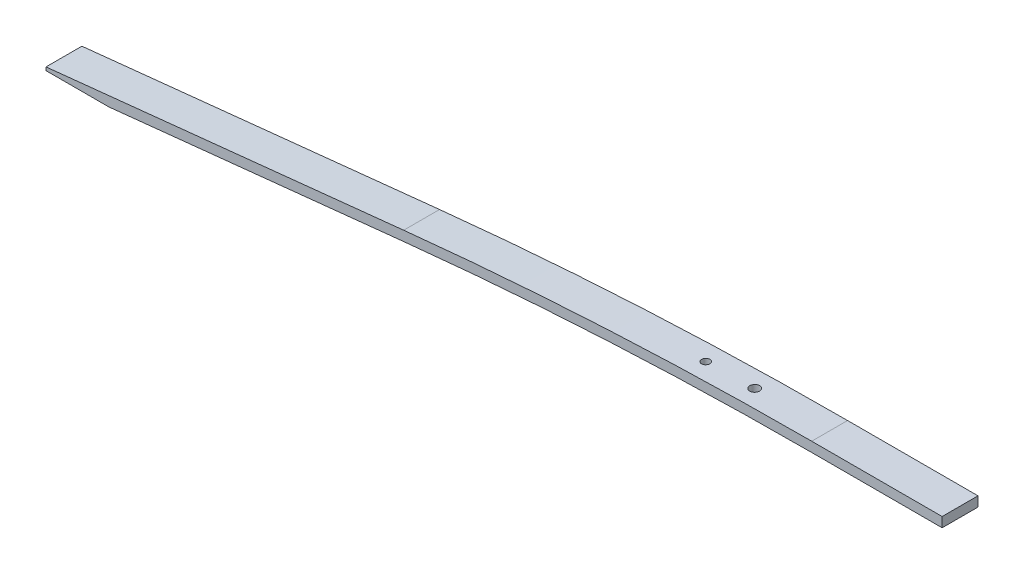
ISO-10303-21;
HEADER;
FILE_DESCRIPTION(('STEP AP214'),'2;1');
FILE_NAME('part.step','',(''),(''),'','','');
FILE_SCHEMA(('AUTOMOTIVE_DESIGN { 1 0 10303 214 1 1 1 1 }'));
ENDSEC;
DATA;
#1=APPLICATION_CONTEXT('core data for automotive mechanical design processes');
#2=APPLICATION_PROTOCOL_DEFINITION('international standard','automotive_design',2000,#1);
#3=PRODUCT_CONTEXT('',#1,'mechanical');
#4=PRODUCT('Part','Part','',(#3));
#5=PRODUCT_RELATED_PRODUCT_CATEGORY('part','',(#4));
#6=PRODUCT_DEFINITION_FORMATION('','',#4);
#7=PRODUCT_DEFINITION_CONTEXT('part definition',#1,'design');
#8=PRODUCT_DEFINITION('design','',#6,#7);
#9=PRODUCT_DEFINITION_SHAPE('','',#8);
#10=(LENGTH_UNIT() NAMED_UNIT(*) SI_UNIT(.MILLI.,.METRE.));
#11=(NAMED_UNIT(*) PLANE_ANGLE_UNIT() SI_UNIT($,.RADIAN.));
#12=(NAMED_UNIT(*) SI_UNIT($,.STERADIAN.) SOLID_ANGLE_UNIT());
#13=UNCERTAINTY_MEASURE_WITH_UNIT(LENGTH_MEASURE(1.E-05),#10,'distance_accuracy_value','');
#14=(GEOMETRIC_REPRESENTATION_CONTEXT(3) GLOBAL_UNCERTAINTY_ASSIGNED_CONTEXT((#13)) GLOBAL_UNIT_ASSIGNED_CONTEXT((#10,
#11,#12)) REPRESENTATION_CONTEXT('',''));
#15=CARTESIAN_POINT('',(0.,0.,0.));
#16=DIRECTION('',(0.,0.,1.));
#17=DIRECTION('',(1.,0.,0.));
#18=AXIS2_PLACEMENT_3D('',#15,#16,#17);
#19=CARTESIAN_POINT('',(-39.9999999999999,-1181.5,5.5));
#20=DIRECTION('',(0.,0.,-1.));
#21=DIRECTION('',(-1.,0.,0.));
#22=AXIS2_PLACEMENT_3D('',#19,#20,#21);
#23=CYLINDRICAL_SURFACE('',#22,1203.);
#24=CARTESIAN_POINT('',(-63.,21.2801129050981,-1.5));
#25=CARTESIAN_POINT('',(-63.0842683275522,21.2785014827461,-1.49999626485822));
#26=CARTESIAN_POINT('',(-63.1685975877517,21.2768799662552,-1.49287504243812));
#27=CARTESIAN_POINT('',(-63.3349334916053,21.2736644200407,-1.46456582440662));
#28=CARTESIAN_POINT('',(-63.4169372149828,21.2720704257815,-1.44336089381558));
#29=CARTESIAN_POINT('',(-63.5761884169983,21.2689593933607,-1.38748729776392));
#30=CARTESIAN_POINT('',(-63.6534381321364,21.2674423190724,-1.35282502021609));
#31=CARTESIAN_POINT('',(-63.8010004359382,21.2645313325327,-1.27102872028861));
#32=CARTESIAN_POINT('',(-63.8713147461398,21.2631373897259,-1.22389780368153));
#33=CARTESIAN_POINT('',(-64.0030365505379,21.2605158899347,-1.11849567663404));
#34=CARTESIAN_POINT('',(-64.0644437578657,21.2592883383092,-1.06022410752971));
#35=CARTESIAN_POINT('',(-64.1766055267503,21.2570390151202,-0.934192625237201));
#36=CARTESIAN_POINT('',(-64.227359679065,21.2560172514622,-0.866432347702361));
#37=CARTESIAN_POINT('',(-64.3167609933638,21.2542131046966,-0.723363238031076));
#38=CARTESIAN_POINT('',(-64.3554105789905,21.2534306736692,-0.648055920995248));
#39=CARTESIAN_POINT('',(-64.4195179260495,21.2521308142561,-0.492019423846686));
#40=CARTESIAN_POINT('',(-64.4449757286982,21.2516133850425,-0.411290260674865));
#41=CARTESIAN_POINT('',(-64.4819724833929,21.2508608890234,-0.246717462662911));
#42=CARTESIAN_POINT('',(-64.4935139803227,21.2506257705915,-0.162874400155196));
#43=CARTESIAN_POINT('',(-64.502358518648,21.2504456234909,0.00555952510740368));
#44=CARTESIAN_POINT('',(-64.4996615957653,21.2505005940944,0.0901503859856601));
#45=CARTESIAN_POINT('',(-64.4801069780458,21.2508987550016,0.257670324424421));
#46=CARTESIAN_POINT('',(-64.4632506262797,21.2512419179692,0.340599558832091));
#47=CARTESIAN_POINT('',(-64.4158579572455,21.2522049189069,0.502450715037225));
#48=CARTESIAN_POINT('',(-64.3853216249189,21.2528247571816,0.581372632423434));
#49=CARTESIAN_POINT('',(-64.3114349986412,21.2543205022846,0.732972722990516));
#50=CARTESIAN_POINT('',(-64.2680841459908,21.2551964202777,0.805650623760621));
#51=CARTESIAN_POINT('',(-64.1698003781107,21.2571754753311,0.942696895225847));
#52=CARTESIAN_POINT('',(-64.1148674587048,21.2582786124733,1.00706526292478));
#53=CARTESIAN_POINT('',(-63.9949696368075,21.2606765351772,1.12567650076369));
#54=CARTESIAN_POINT('',(-63.9300031288645,21.2619713514077,1.17991774741263));
#55=CARTESIAN_POINT('',(-63.7918889331527,21.2647113145791,1.27672380697865));
#56=CARTESIAN_POINT('',(-63.7187412354787,21.2661564617021,1.31928860575835));
#57=CARTESIAN_POINT('',(-63.5663257408067,21.2691524541841,1.39154205415484));
#58=CARTESIAN_POINT('',(-63.4870567571272,21.2707033200311,1.42122819967749));
#59=CARTESIAN_POINT('',(-63.3246610284746,21.2738635250655,1.46687052379746));
#60=CARTESIAN_POINT('',(-63.2415342803373,21.2754728643009,1.48282669113339));
#61=CARTESIAN_POINT('',(-63.0737706319632,21.2787028987153,1.50055776488412));
#62=CARTESIAN_POINT('',(-62.9891335286348,21.2803235954035,1.50233074951858));
#63=CARTESIAN_POINT('',(-62.8207625938515,21.2835299360821,1.49163994435171));
#64=CARTESIAN_POINT('',(-62.7370287626913,21.2851155800611,1.47917614990608));
#65=CARTESIAN_POINT('',(-62.5728397250996,21.2882081449968,1.44036465231928));
#66=CARTESIAN_POINT('',(-62.4923845853229,21.2897150643533,1.41401666706851));
#67=CARTESIAN_POINT('',(-62.3370392674074,21.2926100197493,1.34818381143463));
#68=CARTESIAN_POINT('',(-62.2621490865233,21.2939980558474,1.30869894753246));
#69=CARTESIAN_POINT('',(-62.1200673513715,21.2966194150602,1.21771676375571));
#70=CARTESIAN_POINT('',(-62.052875080903,21.2978527525688,1.16622056275167));
#71=CARTESIAN_POINT('',(-61.928089777219,21.3001341791954,1.05267490478654));
#72=CARTESIAN_POINT('',(-61.8704967402909,21.301182268385,0.990625451907079));
#73=CARTESIAN_POINT('',(-61.7665546041049,21.3030677590313,0.85774508755502));
#74=CARTESIAN_POINT('',(-61.72020374192,21.3039051935225,0.786915555554875));
#75=CARTESIAN_POINT('',(-61.6400513588103,21.3053499178745,0.638478027558064));
#76=CARTESIAN_POINT('',(-61.6062498136728,21.3059572081795,0.560870044640165));
#77=CARTESIAN_POINT('',(-61.5521608546186,21.3069276069541,0.40109152948188));
#78=CARTESIAN_POINT('',(-61.5318713508546,21.3072907531844,0.31892170493206));
#79=CARTESIAN_POINT('',(-61.5053746519992,21.3077647900969,0.152341228465346));
#80=CARTESIAN_POINT('',(-61.4991674733716,21.3078756804842,0.0679305739287923));
#81=CARTESIAN_POINT('',(-61.501011796039,21.3078427132083,-0.10072667719108));
#82=CARTESIAN_POINT('',(-61.5090619371011,21.3076988798473,-0.18497328865741));
#83=CARTESIAN_POINT('',(-61.5391895516435,21.3071597464815,-0.350919169118943));
#84=CARTESIAN_POINT('',(-61.5612670510785,21.3067644460114,-0.432618433400534));
#85=CARTESIAN_POINT('',(-61.6188226065603,21.3057313348782,-0.59115188314902));
#86=CARTESIAN_POINT('',(-61.6543009062461,21.3050935198061,-0.667985980132988));
#87=CARTESIAN_POINT('',(-61.7376487289079,21.3035900999709,-0.814604082711891));
#88=CARTESIAN_POINT('',(-61.7855177696743,21.3027245040723,-0.884388362517123));
#89=CARTESIAN_POINT('',(-61.892286887398,21.3007859232681,-1.01492961751598));
#90=CARTESIAN_POINT('',(-61.9511868335505,21.2997129408217,-1.075686699739));
#91=CARTESIAN_POINT('',(-62.0783648047131,21.2973851997902,-1.186465650037));
#92=CARTESIAN_POINT('',(-62.1466451637613,21.29613039596,-1.23648483834201));
#93=CARTESIAN_POINT('',(-62.290668718301,21.2934699172252,-1.32437675567405));
#94=CARTESIAN_POINT('',(-62.3664165989247,21.2920641475543,-1.36224179495868));
#95=CARTESIAN_POINT('',(-62.5231327400998,21.2891397115476,-1.42467394797319));
#96=CARTESIAN_POINT('',(-62.6040946182265,21.2876211829035,-1.44925698642593));
#97=CARTESIAN_POINT('',(-62.7379766750937,21.2850959691296,-1.47787805329657));
#98=CARTESIAN_POINT('',(-62.7900275211626,21.2841108801281,-1.48616345171972));
#99=CARTESIAN_POINT('',(-62.8947109809195,21.2821228095619,-1.49722559229224));
#100=CARTESIAN_POINT('',(-62.947343594658,21.2811198279956,-1.50000233396278));
#101=CARTESIAN_POINT('',(-63.,21.2801129050981,-1.5));
#102=B_SPLINE_CURVE_WITH_KNOTS('',3,(#24,#25,#26,#27,#28,#29,#30,#31,#32,#33,#34,#35,#36,#37,
#38,#39,#40,#41,#42,#43,#44,#45,#46,#47,#48,#49,#50,#51,#52,#53,#54,#55,#56,#57,#58,#59,#60,#61,
#62,#63,#64,#65,#66,#67,#68,#69,#70,#71,#72,#73,#74,#75,#76,#77,#78,#79,#80,#81,#82,#83,#84,#85,
#86,#87,#88,#89,#90,#91,#92,#93,#94,#95,#96,#97,#98,#99,#100,#101),.UNSPECIFIED.,.T.,.F.,(4,2,2,
2,2,2,2,2,2,2,2,2,2,2,2,2,2,2,2,2,2,2,2,2,2,2,2,2,2,2,2,2,2,2,2,2,2,2,4),(0.,0.252658982755233,
0.505622327116735,0.758465741747327,1.01124623563877,1.26403486895602,1.51683321149394,
1.76958090495644,2.022327808729,2.27502848549765,2.5277285282845,2.78040460430839,
3.03308095847208,3.28576833067874,3.53845579399725,3.7911837312322,4.04391197445887,
4.29668933555308,4.54946690397615,4.8022787224507,5.05509062339745,5.30790766136777,
5.56072457461346,5.81351794705728,6.06631122172977,6.31906482928582,6.57181794917405,
6.82453196777634,7.07724628182889,7.32993648673561,7.58262715919264,7.83532242602248,
8.08800786020801,8.34069029823328,8.5934357230661,8.84634074227099,9.09894185918761,
9.25681983112918,9.41469781679367),.UNSPECIFIED.);
#103=CARTESIAN_POINT('',(-63.,21.2801129050981,-1.5));
#104=VERTEX_POINT('',#103);
#105=EDGE_CURVE('E125',#104,#104,#102,.T.);
#106=ORIENTED_EDGE('',*,*,#105,.F.);
#107=EDGE_LOOP('',(#106));
#108=FACE_BOUND('',#107,.T.);
#109=CARTESIAN_POINT('',(-39.9999999999999,-1181.5,-5.5));
#110=DIRECTION('',(0.,0.,1.));
#111=DIRECTION('',(1.,0.,0.));
#112=AXIS2_PLACEMENT_3D('',#109,#110,#111);
#113=CIRCLE('',#112,1203.);
#114=CARTESIAN_POINT('',(-40.0000000000003,21.5000000000003,-5.5));
#115=VERTEX_POINT('',#114);
#116=CARTESIAN_POINT('',(-165.139891451655,14.973571612624,-5.5));
#117=VERTEX_POINT('',#116);
#118=EDGE_CURVE('E113',#115,#117,#113,.T.);
#119=ORIENTED_EDGE('',*,*,#118,.T.);
#120=DIRECTION('',(0.,0.,-1.));
#121=VECTOR('',#120,1.);
#122=CARTESIAN_POINT('',(-165.139891451655,14.973571612624,5.5));
#123=LINE('',#122,#121);
#124=CARTESIAN_POINT('',(-165.139891451655,14.973571612624,5.5));
#125=VERTEX_POINT('',#124);
#126=EDGE_CURVE('E180',#125,#117,#123,.T.);
#127=ORIENTED_EDGE('',*,*,#126,.F.);
#128=CARTESIAN_POINT('',(-39.9999999999999,-1181.5,5.5));
#129=DIRECTION('',(0.,0.,1.));
#130=DIRECTION('',(1.,0.,0.));
#131=AXIS2_PLACEMENT_3D('',#128,#129,#130);
#132=CIRCLE('',#131,1203.);
#133=CARTESIAN_POINT('',(-40.0000000000003,21.5000000000003,5.5));
#134=VERTEX_POINT('',#133);
#135=EDGE_CURVE('E152',#134,#125,#132,.T.);
#136=ORIENTED_EDGE('',*,*,#135,.F.);
#137=DIRECTION('',(0.,0.,-1.));
#138=VECTOR('',#137,1.);
#139=CARTESIAN_POINT('',(-40.0000000000003,21.5000000000003,5.5));
#140=LINE('',#139,#138);
#141=EDGE_CURVE('E43',#134,#115,#140,.T.);
#142=ORIENTED_EDGE('',*,*,#141,.T.);
#143=EDGE_LOOP('',(#119,#127,#136,#142));
#144=FACE_BOUND('',#143,.T.);
#145=CARTESIAN_POINT('',(-78.,20.8996839653612,-1.25));
#146=CARTESIAN_POINT('',(-78.0702405265001,20.8974641123236,-1.24999688926679));
#147=CARTESIAN_POINT('',(-78.1405317832027,20.8952364464983,-1.2440597052345));
#148=CARTESIAN_POINT('',(-78.2791785067874,20.8908305206302,-1.22045714243557));
#149=CARTESIAN_POINT('',(-78.347531539577,20.8886523233403,-1.20277764314792));
#150=CARTESIAN_POINT('',(-78.4802736174164,20.8844114718202,-1.15619217972843));
#151=CARTESIAN_POINT('',(-78.5446645012633,20.882348764033,-1.1272914694816));
#152=CARTESIAN_POINT('',(-78.6676630699334,20.8783995165602,-1.05908952660006));
#153=CARTESIAN_POINT('',(-78.7262721934895,20.8765129330541,-1.0197908903923));
#154=CARTESIAN_POINT('',(-78.836056194155,20.8729719853001,-0.931908371602947));
#155=CARTESIAN_POINT('',(-78.8872318572814,20.8713175965005,-0.883325472002594));
#156=CARTESIAN_POINT('',(-78.9807016002234,20.8682909555498,-0.778247456985239));
#157=CARTESIAN_POINT('',(-79.0229953516548,20.8669187138305,-0.721752049153747));
#158=CARTESIAN_POINT('',(-79.0974756578555,20.864499139159,-0.602484598538141));
#159=CARTESIAN_POINT('',(-79.1296672890259,20.8634516430226,-0.53971572919772));
#160=CARTESIAN_POINT('',(-79.1830553551444,20.8617130009673,-0.409659839869621));
#161=CARTESIAN_POINT('',(-79.2042518435865,20.8610218533147,-0.342372841865565));
#162=CARTESIAN_POINT('',(-79.2350383947384,20.8600176327435,-0.205224760663816));
#163=CARTESIAN_POINT('',(-79.2446339272386,20.8597043816488,-0.135364906577892));
#164=CARTESIAN_POINT('',(-79.2519634399417,20.8594651268796,0.00497477586042579));
#165=CARTESIAN_POINT('',(-79.2496974626356,20.8595391218179,0.0754546019910284));
#166=CARTESIAN_POINT('',(-79.2333705749958,20.860071982854,0.215015914185071));
#167=CARTESIAN_POINT('',(-79.2193124814289,20.8605307570401,0.28409773015384));
#168=CARTESIAN_POINT('',(-79.1798053186225,20.8618187727725,0.418919895141983));
#169=CARTESIAN_POINT('',(-79.154356236355,20.8626480147424,0.484660240339556));
#170=CARTESIAN_POINT('',(-79.0927878313188,20.8646513781126,0.610941666914802));
#171=CARTESIAN_POINT('',(-79.0566673350277,20.8658255374429,0.671482175527246));
#172=CARTESIAN_POINT('',(-78.9747842571552,20.8684825644781,0.785639792126062));
#173=CARTESIAN_POINT('',(-78.9290216611103,20.8699654326461,0.839256889726944));
#174=CARTESIAN_POINT('',(-78.8291339206092,20.8731953312069,0.938069459393236));
#175=CARTESIAN_POINT('',(-78.7750053842441,20.8749424687395,0.983261499111676));
#176=CARTESIAN_POINT('',(-78.6599364088484,20.878647774865,1.06391754787876));
#177=CARTESIAN_POINT('',(-78.5989959498995,20.8806059440749,1.09938152848133));
#178=CARTESIAN_POINT('',(-78.4719996424118,20.8846760820958,1.15959355825824));
#179=CARTESIAN_POINT('',(-78.4059412065071,20.886788128666,1.18433614506745));
#180=CARTESIAN_POINT('',(-78.2706106523374,20.8911031525725,1.22237895695318));
#181=CARTESIAN_POINT('',(-78.2013385265574,20.8933061301214,1.23567915527161));
#182=CARTESIAN_POINT('',(-78.0615189503606,20.8977402124623,1.25046362975066));
#183=CARTESIAN_POINT('',(-77.9909710283554,20.8999713275589,1.25194344326408));
#184=CARTESIAN_POINT('',(-77.8506275657637,20.9043974148741,1.24303330905545));
#185=CARTESIAN_POINT('',(-77.7808320259177,20.9065923870571,1.23264334965183));
#186=CARTESIAN_POINT('',(-77.6439687753314,20.9108849746025,1.20028613592511));
#187=CARTESIAN_POINT('',(-77.5769012953895,20.9129825817298,1.17831790424671));
#188=CARTESIAN_POINT('',(-77.4474055480962,20.9170225085798,1.12342553591581));
#189=CARTESIAN_POINT('',(-77.3849772762674,20.9189648284525,1.09050140983754));
#190=CARTESIAN_POINT('',(-77.2665482275182,20.9226411281558,1.01463909220106));
#191=CARTESIAN_POINT('',(-77.2105459674209,20.9243751560664,0.971703218402391));
#192=CARTESIAN_POINT('',(-77.1065449050456,20.9275891037422,0.877030637095595));
#193=CARTESIAN_POINT('',(-77.0585460886829,20.9290690239546,0.825293945075605));
#194=CARTESIAN_POINT('',(-76.9719369737282,20.9317351760606,0.714512222423574));
#195=CARTESIAN_POINT('',(-76.9333226161052,20.9329215349314,0.655470368206581));
#196=CARTESIAN_POINT('',(-76.8665547437801,20.9349704919207,0.531736592881054));
#197=CARTESIAN_POINT('',(-76.8384011914606,20.9358330912034,0.467044692091357));
#198=CARTESIAN_POINT('',(-76.7933669270441,20.9372119412661,0.333878373157274));
#199=CARTESIAN_POINT('',(-76.7764811670088,20.9377283471402,0.265405663710645));
#200=CARTESIAN_POINT('',(-76.7544430855582,20.9384021798717,0.126595552407409));
#201=CARTESIAN_POINT('',(-76.7492907630984,20.938559606761,0.0562581507167891));
#202=CARTESIAN_POINT('',(-76.750866101445,20.9385114596353,-0.0842634804190168));
#203=CARTESIAN_POINT('',(-76.7575904204575,20.9383059877309,-0.154447747389243));
#204=CARTESIAN_POINT('',(-76.7827211468489,20.9375374966255,-0.2926907256518));
#205=CARTESIAN_POINT('',(-76.8011275723121,20.9369744768709,-0.360749433653527));
#206=CARTESIAN_POINT('',(-76.849099061916,20.9355053267315,-0.492810833411267));
#207=CARTESIAN_POINT('',(-76.878664321969,20.9345991903227,-0.556813453932706));
#208=CARTESIAN_POINT('',(-76.9481112873589,20.9324672404068,-0.678943701741664));
#209=CARTESIAN_POINT('',(-76.9879925988712,20.9312414391032,-0.737071553186012));
#210=CARTESIAN_POINT('',(-77.0769458487,20.9285018500472,-0.845817194816037));
#211=CARTESIAN_POINT('',(-77.1260193759767,20.9269880125045,-0.896433683877602));
#212=CARTESIAN_POINT('',(-77.2319743089951,20.9237118803487,-0.988722877611554));
#213=CARTESIAN_POINT('',(-77.2888576690365,20.9219495235442,-1.03039333695497));
#214=CARTESIAN_POINT('',(-77.4088544857664,20.9182222547882,-1.10362783833412));
#215=CARTESIAN_POINT('',(-77.4719736530704,20.9162571570966,-1.13518250218706));
#216=CARTESIAN_POINT('',(-77.6025596881592,20.9121804749191,-1.1872109793965));
#217=CARTESIAN_POINT('',(-77.6700212507452,20.9100690689486,-1.2076980371596));
#218=CARTESIAN_POINT('',(-77.7815930516467,20.9065672982061,-1.23155584341853));
#219=CARTESIAN_POINT('',(-77.8249795864705,20.9052032589859,-1.23846380708468));
#220=CARTESIAN_POINT('',(-77.9122374780427,20.902455151833,-1.24768685786243));
#221=CARTESIAN_POINT('',(-77.9561088349149,20.9010710838952,-1.25000194380241));
#222=CARTESIAN_POINT('',(-78.,20.8996839653612,-1.25));
#223=B_SPLINE_CURVE_WITH_KNOTS('',3,(#145,#146,#147,#148,#149,#150,#151,#152,#153,#154,#155,
#156,#157,#158,#159,#160,#161,#162,#163,#164,#165,#166,#167,#168,#169,#170,#171,#172,#173,#174,
#175,#176,#177,#178,#179,#180,#181,#182,#183,#184,#185,#186,#187,#188,#189,#190,#191,#192,#193,
#194,#195,#196,#197,#198,#199,#200,#201,#202,#203,#204,#205,#206,#207,#208,#209,#210,#211,#212,
#213,#214,#215,#216,#217,#218,#219,#220,#221,#222),.UNSPECIFIED.,.T.,.F.,(4,2,2,2,2,2,2,2,2,2,2,
2,2,2,2,2,2,2,2,2,2,2,2,2,2,2,2,2,2,2,2,2,2,2,2,2,2,2,4),(0.,0.210666539578859,
0.421586872401316,0.632408569037846,0.843177671783519,1.05392447147793,1.26467906158282,
1.47532757549444,1.68597506453892,1.896523195606,2.10707057243968,2.31756767042643,
2.52806500916354,2.73858550465698,2.94910631593887,3.15971270632739,3.37031971254898,
3.58103389360461,3.79174856741517,4.00254279031318,4.21333722066337,4.4241494476288,
4.63496147112639,4.84572473916788,5.05648763630111,5.26715920991632,5.47783002594044,
5.68840639857194,5.89898275245891,6.10949986479555,6.32001730302008,6.53053843740907,
6.74105153614954,6.95160105767633,7.16220336258209,7.37300035244822,7.58354452336481,
7.71518359226914,7.84682269475434),.UNSPECIFIED.);
#224=CARTESIAN_POINT('',(-78.,20.8996839653612,-1.25));
#225=VERTEX_POINT('',#224);
#226=EDGE_CURVE('E186',#225,#225,#223,.T.);
#227=ORIENTED_EDGE('',*,*,#226,.F.);
#228=EDGE_LOOP('',(#227));
#229=FACE_BOUND('',#228,.T.);
#230=ADVANCED_FACE('F30',(#108,#144,#229),#23,.T.);
#231=CARTESIAN_POINT('',(-39.9999999999999,-1181.5,5.5));
#232=DIRECTION('',(0.,0.,-1.));
#233=DIRECTION('',(-1.,0.,0.));
#234=AXIS2_PLACEMENT_3D('',#231,#232,#233);
#235=CYLINDRICAL_SURFACE('',#234,1200.);
#236=CARTESIAN_POINT('',(-63.,18.279563086486,-1.5));
#237=CARTESIAN_POINT('',(-62.9157341421218,18.2811784661517,-1.49999626537084));
#238=CARTESIAN_POINT('',(-62.8314070259426,18.2827860693684,-1.49287546225));
#239=CARTESIAN_POINT('',(-62.6650746501325,18.2859397968327,-1.46456757628875));
#240=CARTESIAN_POINT('',(-62.5830723084334,18.2874858447246,-1.44336356699848));
#241=CARTESIAN_POINT('',(-62.4238230902503,18.2904727485298,-1.38749200252341));
#242=CARTESIAN_POINT('',(-62.3465739839619,18.2919136538267,-1.35283081692579));
#243=CARTESIAN_POINT('',(-62.1990124669922,18.2946529712941,-1.27103679181813));
#244=CARTESIAN_POINT('',(-62.1286983351766,18.295951418829,-1.22390705752136));
#245=CARTESIAN_POINT('',(-61.9969778117579,18.2983736087522,-1.11850838253607));
#246=CARTESIAN_POINT('',(-61.9355715518016,18.2994973485584,-1.06023927725164));
#247=CARTESIAN_POINT('',(-61.8234110989732,18.3015427073451,-0.934213339505746));
#248=CARTESIAN_POINT('',(-61.7726573159219,18.3024643185493,-0.866456142186719));
#249=CARTESIAN_POINT('',(-61.683255206698,18.3040833610534,-0.723392563724157));
#250=CARTESIAN_POINT('',(-61.6446046665989,18.3047808333533,-0.648087566555704));
#251=CARTESIAN_POINT('',(-61.5804948541377,18.305935672853,-0.492055990275509));
#252=CARTESIAN_POINT('',(-61.5550355440438,18.3063930407395,-0.411329426672266));
#253=CARTESIAN_POINT('',(-61.5180342240754,18.3070572176029,-0.246758271008586));
#254=CARTESIAN_POINT('',(-61.5064902750925,18.3072640614904,-0.162914115064227));
#255=CARTESIAN_POINT('',(-61.4976412658055,18.3074226476949,0.005522324433102));
#256=CARTESIAN_POINT('',(-61.5003361727091,18.3073743905994,0.09011460626268));
#257=CARTESIAN_POINT('',(-61.5198875619682,18.3070238721335,0.257640204847131));
#258=CARTESIAN_POINT('',(-61.5367431035577,18.3067216276367,0.340573631433816));
#259=CARTESIAN_POINT('',(-61.5841356274428,18.3058699832412,0.50243331894956));
#260=CARTESIAN_POINT('',(-61.614672624125,18.3053205830826,0.581359575664828));
#261=CARTESIAN_POINT('',(-61.688561659968,18.3039871794401,0.732967124023946));
#262=CARTESIAN_POINT('',(-61.7319140835107,18.3032031689195,0.805648228268288));
#263=CARTESIAN_POINT('',(-61.8302022394343,18.3014188514396,0.942700471833772));
#264=CARTESIAN_POINT('',(-61.8851379730317,18.3004185444577,1.00707161028216));
#265=CARTESIAN_POINT('',(-62.0050398942548,18.2982254555702,1.12568495538801));
#266=CARTESIAN_POINT('',(-62.0700072589708,18.2970326510765,1.17992597174593));
#267=CARTESIAN_POINT('',(-62.2081231445968,18.2944840800455,1.27673132891321));
#268=CARTESIAN_POINT('',(-62.2812716736022,18.2931283133468,1.31929565816801));
#269=CARTESIAN_POINT('',(-62.4336860877362,18.2902881471846,1.39154672844212));
#270=CARTESIAN_POINT('',(-62.5129529678701,18.2888037267938,1.42123136966515));
#271=CARTESIAN_POINT('',(-62.6753436598606,18.2857456147934,1.46687140472614));
#272=CARTESIAN_POINT('',(-62.7584674749717,18.2841719231084,1.48282678697934));
#273=CARTESIAN_POINT('',(-62.9262253108621,18.2809780249106,1.50055742576339));
#274=CARTESIAN_POINT('',(-63.0108595494855,18.2793578116672,1.50233062000015));
#275=CARTESIAN_POINT('',(-63.1792242416178,18.2761168876296,1.49164134920058));
#276=CARTESIAN_POINT('',(-63.2629546946071,18.2744961768351,1.47917887597959));
#277=CARTESIAN_POINT('',(-63.4271403890917,18.2713014734355,1.44037053711169));
#278=CARTESIAN_POINT('',(-63.5075954252993,18.2697274837603,1.41402380270349));
#279=CARTESIAN_POINT('',(-63.662940517273,18.266673686034,1.34819371355884));
#280=CARTESIAN_POINT('',(-63.7378305744417,18.2651938779592,1.30871036213342));
#281=CARTESIAN_POINT('',(-63.8799148613946,18.2623742736557,1.21772976279629));
#282=CARTESIAN_POINT('',(-63.9471095381983,18.2610344692946,1.16623321325158));
#283=CARTESIAN_POINT('',(-64.071899435858,18.258537190239,1.05268606483855));
#284=CARTESIAN_POINT('',(-64.1294946603683,18.2573797154751,0.990635469988031));
#285=CARTESIAN_POINT('',(-64.2334405376261,18.255284660154,0.857752273496796));
#286=CARTESIAN_POINT('',(-64.2797930135843,18.2543470439436,0.786921098601587));
#287=CARTESIAN_POINT('',(-64.3599481176717,18.2527222481416,0.638479462628585));
#288=CARTESIAN_POINT('',(-64.3937507729874,18.2520350680075,0.560869016237032));
#289=CARTESIAN_POINT('',(-64.447840027395,18.2509340920814,0.401088219533285));
#290=CARTESIAN_POINT('',(-64.468129271395,18.2505202427921,0.318918764944134));
#291=CARTESIAN_POINT('',(-64.4946255692782,18.2499795776225,0.152338865304778));
#292=CARTESIAN_POINT('',(-64.5008326103527,18.2498527620034,0.0679284182163282));
#293=CARTESIAN_POINT('',(-64.4989881137675,18.2498904280225,-0.10072511412918));
#294=CARTESIAN_POINT('',(-64.4909384868302,18.2500548706253,-0.184968220298921));
#295=CARTESIAN_POINT('',(-64.4608131274851,18.2506694497272,-0.35090714523575));
#296=CARTESIAN_POINT('',(-64.4387373696835,18.2511195867434,-0.432602959390782));
#297=CARTESIAN_POINT('',(-64.3811866275955,18.2522905006226,-0.591129744772492));
#298=CARTESIAN_POINT('',(-64.3457114014821,18.25301128237,-0.667960628170083));
#299=CARTESIAN_POINT('',(-64.262371087872,18.2546995443149,-0.814572922459948));
#300=CARTESIAN_POINT('',(-64.2145064798273,18.2556670149657,-0.884354606001282));
#301=CARTESIAN_POINT('',(-64.1077453824501,18.2578170011078,-1.01489426873169));
#302=CARTESIAN_POINT('',(-64.0488485996284,18.2589995223201,-1.07565200777935));
#303=CARTESIAN_POINT('',(-63.9216771194761,18.261541890532,-1.18643295751627));
#304=CARTESIAN_POINT('',(-63.8534000857862,18.2629017817051,-1.23645348588665));
#305=CARTESIAN_POINT('',(-63.7093799899801,18.2657565075553,-1.32435077104754));
#306=CARTESIAN_POINT('',(-63.6336319368908,18.2672514323839,-1.36221933696031));
#307=CARTESIAN_POINT('',(-63.4769144096465,18.2703282739626,-1.42465827801486));
#308=CARTESIAN_POINT('',(-63.3959513184223,18.2719100840331,-1.44924457637147));
#309=CARTESIAN_POINT('',(-63.2620606740876,18.2745118157397,-1.47787168987484));
#310=CARTESIAN_POINT('',(-63.2100026899548,18.2755200520028,-1.48615944927497));
#311=CARTESIAN_POINT('',(-63.1053044463346,18.2775409001548,-1.49722477167362));
#312=CARTESIAN_POINT('',(-63.0526641867822,18.2785535120442,-1.50000233405572));
#313=CARTESIAN_POINT('',(-63.,18.279563086486,-1.5));
#314=B_SPLINE_CURVE_WITH_KNOTS('',3,(#236,#237,#238,#239,#240,#241,#242,#243,#244,#245,#246,
#247,#248,#249,#250,#251,#252,#253,#254,#255,#256,#257,#258,#259,#260,#261,#262,#263,#264,#265,
#266,#267,#268,#269,#270,#271,#272,#273,#274,#275,#276,#277,#278,#279,#280,#281,#282,#283,#284,
#285,#286,#287,#288,#289,#290,#291,#292,#293,#294,#295,#296,#297,#298,#299,#300,#301,#302,#303,
#304,#305,#306,#307,#308,#309,#310,#311,#312,#313),.UNSPECIFIED.,.T.,.F.,(4,2,2,2,2,2,2,2,2,2,2,
2,2,2,2,2,2,2,2,2,2,2,2,2,2,2,2,2,2,2,2,2,2,2,2,2,2,2,4),(0.,0.25265178310123,0.505607776420292,
0.758444185601955,1.01121768665167,1.26399492298391,1.5167818823487,1.76952257484722,
2.02226254440673,2.2749672905285,2.5276714546677,2.78035883165952,3.03304647436245,
3.28574169686674,3.53843694591042,3.79116186824515,4.04388704066081,4.29665339980119,
4.54941997222604,4.80222329987744,5.05502677287598,5.30784606608644,5.56066529557492,
5.81346983150492,6.06627427119526,6.31903768671862,6.57180055468275,6.82451393616757,
7.07722754750997,7.32990729196062,7.58258749387953,7.83527225626368,8.08794724155772,
8.34062894972793,8.5933737083656,8.84628847033364,9.09889935318976,9.25680078020464,
9.41470222488376),.UNSPECIFIED.);
#315=CARTESIAN_POINT('',(-63.,18.279563086486,-1.5));
#316=VERTEX_POINT('',#315);
#317=EDGE_CURVE('E128',#316,#316,#314,.T.);
#318=ORIENTED_EDGE('',*,*,#317,.F.);
#319=EDGE_LOOP('',(#318));
#320=FACE_BOUND('',#319,.T.);
#321=CARTESIAN_POINT('',(-39.9999999999999,-1181.5,-5.5));
#322=DIRECTION('',(0.,0.,-1.));
#323=DIRECTION('',(1.,0.,0.));
#324=AXIS2_PLACEMENT_3D('',#321,#322,#323);
#325=CIRCLE('',#324,1200.);
#326=CARTESIAN_POINT('',(-164.827821896913,11.9898469951354,-5.5));
#327=VERTEX_POINT('',#326);
#328=CARTESIAN_POINT('',(-40.,18.4999999999999,-5.5));
#329=VERTEX_POINT('',#328);
#330=EDGE_CURVE('E145',#327,#329,#325,.T.);
#331=ORIENTED_EDGE('',*,*,#330,.T.);
#332=DIRECTION('',(0.,0.,-1.));
#333=VECTOR('',#332,1.);
#334=CARTESIAN_POINT('',(-40.,18.4999999999999,5.5));
#335=LINE('',#334,#333);
#336=CARTESIAN_POINT('',(-40.,18.4999999999999,5.5));
#337=VERTEX_POINT('',#336);
#338=EDGE_CURVE('E165',#337,#329,#335,.T.);
#339=ORIENTED_EDGE('',*,*,#338,.F.);
#340=CARTESIAN_POINT('',(-39.9999999999999,-1181.5,5.5));
#341=DIRECTION('',(0.,0.,-1.));
#342=DIRECTION('',(1.,0.,0.));
#343=AXIS2_PLACEMENT_3D('',#340,#341,#342);
#344=CIRCLE('',#343,1200.);
#345=CARTESIAN_POINT('',(-164.827821896913,11.9898469951354,5.5));
#346=VERTEX_POINT('',#345);
#347=EDGE_CURVE('E56',#346,#337,#344,.T.);
#348=ORIENTED_EDGE('',*,*,#347,.F.);
#349=DIRECTION('',(0.,0.,-1.));
#350=VECTOR('',#349,1.);
#351=CARTESIAN_POINT('',(-164.827821896913,11.9898469951354,5.5));
#352=LINE('',#351,#350);
#353=EDGE_CURVE('E168',#346,#327,#352,.T.);
#354=ORIENTED_EDGE('',*,*,#353,.T.);
#355=EDGE_LOOP('',(#331,#339,#348,#354));
#356=FACE_BOUND('',#355,.T.);
#357=CARTESIAN_POINT('',(-78.,17.8981824231681,-1.25));
#358=CARTESIAN_POINT('',(-77.9297622445753,17.9004077259609,-1.24999688986215));
#359=CARTESIAN_POINT('',(-77.859473384867,17.9026284232545,-1.24406017656859));
#360=CARTESIAN_POINT('',(-77.7208305830074,17.9069967142124,-1.22045909918485));
#361=CARTESIAN_POINT('',(-77.6524790722571,17.9091442166456,-1.2027806243421));
#362=CARTESIAN_POINT('',(-77.5197391445365,17.9133039041742,-1.15619740068495));
#363=CARTESIAN_POINT('',(-77.4553488965554,17.9153161518288,-1.1272978844202));
#364=CARTESIAN_POINT('',(-77.3323511134598,17.9191508189969,-1.05909840495509));
#365=CARTESIAN_POINT('',(-77.2737421400578,17.9209732857312,-1.01980103757574));
#366=CARTESIAN_POINT('',(-77.1639595483456,17.9243799138751,-0.931922299820304));
#367=CARTESIAN_POINT('',(-77.1127849616436,17.9259641063229,-0.883342140518303));
#368=CARTESIAN_POINT('',(-77.019316723553,17.9288525717814,-0.778270294908718));
#369=CARTESIAN_POINT('',(-76.9770234011692,17.9301568344221,-0.721778315638246));
#370=CARTESIAN_POINT('',(-76.9025422603707,17.9324506897465,-0.602517050747541));
#371=CARTESIAN_POINT('',(-76.8703495951068,17.9334404333566,-0.539750794994067));
#372=CARTESIAN_POINT('',(-76.8169588295959,17.9350804691803,-0.409700455755223));
#373=CARTESIAN_POINT('',(-76.7957606797925,17.935730762924,-0.3424163926348));
#374=CARTESIAN_POINT('',(-76.7649690556987,17.9366749812365,-0.205270176045196));
#375=CARTESIAN_POINT('',(-76.7553707946853,17.9369690528014,-0.135409098260188));
#376=CARTESIAN_POINT('',(-76.7480363087886,17.9371937877982,0.00493339548145489));
#377=CARTESIAN_POINT('',(-76.7503000447241,17.9371244524306,0.0754148093882945));
#378=CARTESIAN_POINT('',(-76.7666233523153,17.936624200097,0.21498247713925));
#379=CARTESIAN_POINT('',(-76.7806805617698,17.9361933555404,0.284069007537217));
#380=CARTESIAN_POINT('',(-76.8201876153146,17.9349812187813,0.418900761566343));
#381=CARTESIAN_POINT('',(-76.845637471658,17.9341999262018,0.484645981603753));
#382=CARTESIAN_POINT('',(-76.9072086322778,17.932306924808,0.610935766804541));
#383=CARTESIAN_POINT('',(-76.9433309122596,17.9311951857831,0.671479855811214));
#384=CARTESIAN_POINT('',(-77.0252189493568,17.9286701734611,0.785644138659054));
#385=CARTESIAN_POINT('',(-77.0709847175892,17.9272568998164,0.839264324518194));
#386=CARTESIAN_POINT('',(-77.1708770556694,17.9241653355073,0.93807919215634));
#387=CARTESIAN_POINT('',(-77.2250065340788,17.922486952644,0.983270930748186));
#388=CARTESIAN_POINT('',(-77.3400773433405,17.9189101110202,1.0639261093918));
#389=CARTESIAN_POINT('',(-77.4010186920834,17.9170116516817,1.09938952389249));
#390=CARTESIAN_POINT('',(-77.5280136901113,17.91304487718,1.1595988254963));
#391=CARTESIAN_POINT('',(-77.5940697129424,17.9109764831283,1.18433970107199));
#392=CARTESIAN_POINT('',(-77.729394483899,17.9067272495639,1.2223799143059));
#393=CARTESIAN_POINT('',(-77.7986632396594,17.904546409784,1.23567922477167));
#394=CARTESIAN_POINT('',(-77.9384762028603,17.9001321143057,1.25046323455511));
#395=CARTESIAN_POINT('',(-78.009020899806,17.8978986383097,1.25194329883236));
#396=CARTESIAN_POINT('',(-78.149357323827,17.8934431474534,1.24303492517658));
#397=CARTESIAN_POINT('',(-78.2191490499011,17.8912211326083,1.23264647146456));
#398=CARTESIAN_POINT('',(-78.3560086120066,17.8868522266288,1.20029283399427));
#399=CARTESIAN_POINT('',(-78.4230760572634,17.8847053462779,1.17832599568814));
#400=CARTESIAN_POINT('',(-78.552571706957,17.880549873848,1.12343668542639));
#401=CARTESIAN_POINT('',(-78.6149999143341,17.8785412816814,1.0905142204145));
#402=CARTESIAN_POINT('',(-78.7334320053508,17.874722411682,1.0146535539308));
#403=CARTESIAN_POINT('',(-78.7894370661285,17.8729120975146,0.971717192045389));
#404=CARTESIAN_POINT('',(-78.8934434625324,17.8695438724404,0.877042696705428));
#405=CARTESIAN_POINT('',(-78.9414448122209,17.8679859610902,0.825304578715521));
#406=CARTESIAN_POINT('',(-79.0280581909805,17.8651706450019,0.714519411660195));
#407=CARTESIAN_POINT('',(-79.0666743587346,17.8639131078089,0.655475601661311));
#408=CARTESIAN_POINT('',(-79.1334452569185,17.8617363344319,0.531736964317758));
#409=CARTESIAN_POINT('',(-79.1616000284616,17.8608170969184,0.467042159182669));
#410=CARTESIAN_POINT('',(-79.206634475937,17.8593457859167,0.333873150587103));
#411=CARTESIAN_POINT('',(-79.2235198509939,17.8587935268419,0.265400876454343));
#412=CARTESIAN_POINT('',(-79.2455573063289,17.8580726184901,0.126591459168239));
#413=CARTESIAN_POINT('',(-79.2507093919081,17.8579039690397,0.0562543168574418));
#414=CARTESIAN_POINT('',(-79.2491337067108,17.8579555344344,-0.0842629374860304));
#415=CARTESIAN_POINT('',(-79.2424099182233,17.8581756189269,-0.154443094259088));
#416=CARTESIAN_POINT('',(-79.2172816909216,17.8589975368836,-0.292677904915012));
#417=CARTESIAN_POINT('',(-79.1988772346738,17.8595993709175,-0.360732555625368));
#418=CARTESIAN_POINT('',(-79.1509112430214,17.8611660883503,-0.492786108548686));
#419=CARTESIAN_POINT('',(-79.1213495132805,17.8621309780728,-0.55678494009507));
#420=CARTESIAN_POINT('',(-79.0519112083704,17.8643939322076,-0.678908321091379));
#421=CARTESIAN_POINT('',(-79.012035023835,17.8656919840023,-0.737033092890492));
#422=CARTESIAN_POINT('',(-78.9230910639974,17.868581778239,-0.845776758154242));
#423=CARTESIAN_POINT('',(-78.8740212063787,17.8701735872143,-0.896393946529806));
#424=CARTESIAN_POINT('',(-78.7680738287059,17.8736028671524,-0.988685334474198));
#425=CARTESIAN_POINT('',(-78.7111943516589,17.8754403996875,-1.03035728574767));
#426=CARTESIAN_POINT('',(-78.5912015944745,17.8793072935783,-1.10359791730174));
#427=CARTESIAN_POINT('',(-78.5280822456705,17.881336841597,-1.13515663278689));
#428=CARTESIAN_POINT('',(-78.3974946625207,17.885524613968,-1.18719291170794));
#429=CARTESIAN_POINT('',(-78.3300317338988,17.8876826810997,-1.20768371771365));
#430=CARTESIAN_POINT('',(-78.2184500581009,17.8912422271829,-1.23154849657224));
#431=CARTESIAN_POINT('',(-78.1750552825344,17.8926242310965,-1.23845918628404));
#432=CARTESIAN_POINT('',(-78.0877803260788,17.8953988974441,-1.24768591061697));
#433=CARTESIAN_POINT('',(-78.0439001450487,17.8967915598811,-1.2500019439047));
#434=CARTESIAN_POINT('',(-78.,17.8981824231681,-1.25));
#435=B_SPLINE_CURVE_WITH_KNOTS('',3,(#357,#358,#359,#360,#361,#362,#363,#364,#365,#366,#367,
#368,#369,#370,#371,#372,#373,#374,#375,#376,#377,#378,#379,#380,#381,#382,#383,#384,#385,#386,
#387,#388,#389,#390,#391,#392,#393,#394,#395,#396,#397,#398,#399,#400,#401,#402,#403,#404,#405,
#406,#407,#408,#409,#410,#411,#412,#413,#414,#415,#416,#417,#418,#419,#420,#421,#422,#423,#424,
#425,#426,#427,#428,#429,#430,#431,#432,#433,#434),.UNSPECIFIED.,.T.,.F.,(4,2,2,2,2,2,2,2,2,2,2,
2,2,2,2,2,2,2,2,2,2,2,2,2,2,2,2,2,2,2,2,2,2,2,2,2,2,2,4),(0.,0.210658725222605,
0.421571070367265,0.632385181629927,0.843146712776954,1.05388076579337,1.26462262404147,
1.47526320158258,1.6859028296816,1.89645550710069,2.10700748904536,2.31751730805476,
2.52802735347349,2.73855665031791,2.94908618986296,3.15968910857229,3.37029258041682,
3.58099437877155,3.79169667788671,4.00248160204586,4.21326680644038,4.4240821401502,
4.63489734024407,4.84567384334091,5.05644997610821,5.26713299135704,5.47781517861524,
5.68839073942794,5.89896620510444,6.10947107276277,6.31997625460373,6.53048510317458,
6.74098598042422,6.95153459273416,7.16213606251755,7.37294440907172,7.58349996505513,
7.71516627263171,7.84683261841871),.UNSPECIFIED.);
#436=CARTESIAN_POINT('',(-78.,17.8981824231681,-1.25));
#437=VERTEX_POINT('',#436);
#438=EDGE_CURVE('E34',#437,#437,#435,.T.);
#439=ORIENTED_EDGE('',*,*,#438,.F.);
#440=EDGE_LOOP('',(#439));
#441=FACE_BOUND('',#440,.T.);
#442=ADVANCED_FACE('F187',(#320,#356,#441),#235,.F.);
#443=CARTESIAN_POINT('',(0.,18.5,5.5));
#444=DIRECTION('',(-1.,0.,0.));
#445=DIRECTION('',(0.,-1.,0.));
#446=AXIS2_PLACEMENT_3D('',#443,#444,#445);
#447=PLANE('',#446);
#448=DIRECTION('',(0.,1.,0.));
#449=VECTOR('',#448,1.);
#450=CARTESIAN_POINT('',(0.,18.5,-5.5));
#451=LINE('',#450,#449);
#452=CARTESIAN_POINT('',(0.,18.5,-5.5));
#453=VERTEX_POINT('',#452);
#454=CARTESIAN_POINT('',(0.,21.5,-5.5));
#455=VERTEX_POINT('',#454);
#456=EDGE_CURVE('E111',#453,#455,#451,.T.);
#457=ORIENTED_EDGE('',*,*,#456,.T.);
#458=DIRECTION('',(0.,0.,-1.));
#459=VECTOR('',#458,1.);
#460=CARTESIAN_POINT('',(0.,21.5,5.5));
#461=LINE('',#460,#459);
#462=CARTESIAN_POINT('',(0.,21.5,5.5));
#463=VERTEX_POINT('',#462);
#464=EDGE_CURVE('E11',#463,#455,#461,.T.);
#465=ORIENTED_EDGE('',*,*,#464,.F.);
#466=DIRECTION('',(0.,1.,0.));
#467=VECTOR('',#466,1.);
#468=CARTESIAN_POINT('',(0.,18.5,5.5));
#469=LINE('',#468,#467);
#470=CARTESIAN_POINT('',(0.,18.5,5.5));
#471=VERTEX_POINT('',#470);
#472=EDGE_CURVE('E149',#471,#463,#469,.T.);
#473=ORIENTED_EDGE('',*,*,#472,.F.);
#474=DIRECTION('',(0.,0.,-1.));
#475=VECTOR('',#474,1.);
#476=CARTESIAN_POINT('',(0.,18.5,5.5));
#477=LINE('',#476,#475);
#478=EDGE_CURVE('E124',#471,#453,#477,.T.);
#479=ORIENTED_EDGE('',*,*,#478,.T.);
#480=EDGE_LOOP('',(#457,#465,#473,#479));
#481=FACE_BOUND('',#480,.T.);
#482=ADVANCED_FACE('F32',(#481),#447,.F.);
#483=CARTESIAN_POINT('',(0.,21.5,5.5));
#484=DIRECTION('',(0.,-1.,0.));
#485=DIRECTION('',(1.,0.,0.));
#486=AXIS2_PLACEMENT_3D('',#483,#484,#485);
#487=PLANE('',#486);
#488=DIRECTION('',(-1.,0.,0.));
#489=VECTOR('',#488,1.);
#490=CARTESIAN_POINT('',(0.,21.5,-5.5));
#491=LINE('',#490,#489);
#492=EDGE_CURVE('E107',#455,#115,#491,.T.);
#493=ORIENTED_EDGE('',*,*,#492,.T.);
#494=ORIENTED_EDGE('',*,*,#141,.F.);
#495=DIRECTION('',(-1.,0.,0.));
#496=VECTOR('',#495,1.);
#497=CARTESIAN_POINT('',(0.,21.5,5.5));
#498=LINE('',#497,#496);
#499=EDGE_CURVE('E120',#463,#134,#498,.T.);
#500=ORIENTED_EDGE('',*,*,#499,.F.);
#501=ORIENTED_EDGE('',*,*,#464,.T.);
#502=EDGE_LOOP('',(#493,#494,#500,#501));
#503=FACE_BOUND('',#502,.T.);
#504=ADVANCED_FACE('F119',(#503),#487,.F.);
#505=CARTESIAN_POINT('',(-274.839724552538,3.5,5.5));
#506=DIRECTION('',(0.104023184914096,-0.994574872495946,0.));
#507=DIRECTION('',(0.994574872495946,0.104023184914096,0.));
#508=AXIS2_PLACEMENT_3D('',#505,#506,#507);
#509=PLANE('',#508);
#510=DIRECTION('',(-0.994574872495946,-0.104023184914096,0.));
#511=VECTOR('',#510,1.);
#512=CARTESIAN_POINT('',(-274.839724552538,3.5,-5.5));
#513=LINE('',#512,#511);
#514=CARTESIAN_POINT('',(-274.839724552538,3.5,-5.5));
#515=VERTEX_POINT('',#514);
#516=EDGE_CURVE('E137',#117,#515,#513,.T.);
#517=ORIENTED_EDGE('',*,*,#516,.T.);
#518=DIRECTION('',(0.,0.,-1.));
#519=VECTOR('',#518,1.);
#520=CARTESIAN_POINT('',(-274.839724552538,3.5,5.5));
#521=LINE('',#520,#519);
#522=CARTESIAN_POINT('',(-274.839724552538,3.5,5.5));
#523=VERTEX_POINT('',#522);
#524=EDGE_CURVE('E177',#523,#515,#521,.T.);
#525=ORIENTED_EDGE('',*,*,#524,.F.);
#526=DIRECTION('',(-0.994574872495946,-0.104023184914096,0.));
#527=VECTOR('',#526,1.);
#528=CARTESIAN_POINT('',(-274.839724552538,3.5,5.5));
#529=LINE('',#528,#527);
#530=EDGE_CURVE('E154',#125,#523,#529,.T.);
#531=ORIENTED_EDGE('',*,*,#530,.F.);
#532=ORIENTED_EDGE('',*,*,#126,.T.);
#533=EDGE_LOOP('',(#517,#525,#531,#532));
#534=FACE_BOUND('',#533,.T.);
#535=ADVANCED_FACE('F222',(#534),#509,.F.);
#536=CARTESIAN_POINT('',(-274.839724552538,2.5,5.5));
#537=DIRECTION('',(1.,0.,0.));
#538=DIRECTION('',(0.,0.,-1.));
#539=AXIS2_PLACEMENT_3D('',#536,#537,#538);
#540=PLANE('',#539);
#541=DIRECTION('',(0.,-1.,0.));
#542=VECTOR('',#541,1.);
#543=CARTESIAN_POINT('',(-274.839724552538,2.5,-5.5));
#544=LINE('',#543,#542);
#545=CARTESIAN_POINT('',(-274.839724552538,2.5,-5.5));
#546=VERTEX_POINT('',#545);
#547=EDGE_CURVE('E139',#515,#546,#544,.T.);
#548=ORIENTED_EDGE('',*,*,#547,.T.);
#549=DIRECTION('',(0.,0.,-1.));
#550=VECTOR('',#549,1.);
#551=CARTESIAN_POINT('',(-274.839724552538,2.5,5.5));
#552=LINE('',#551,#550);
#553=CARTESIAN_POINT('',(-274.839724552538,2.5,5.5));
#554=VERTEX_POINT('',#553);
#555=EDGE_CURVE('E174',#554,#546,#552,.T.);
#556=ORIENTED_EDGE('',*,*,#555,.F.);
#557=DIRECTION('',(0.,-1.,0.));
#558=VECTOR('',#557,1.);
#559=CARTESIAN_POINT('',(-274.839724552538,2.5,5.5));
#560=LINE('',#559,#558);
#561=EDGE_CURVE('E156',#523,#554,#560,.T.);
#562=ORIENTED_EDGE('',*,*,#561,.F.);
#563=ORIENTED_EDGE('',*,*,#524,.T.);
#564=EDGE_LOOP('',(#548,#556,#562,#563));
#565=FACE_BOUND('',#564,.T.);
#566=ADVANCED_FACE('F269',(#565),#540,.F.);
#567=CARTESIAN_POINT('',(-255.561088456553,2.5,5.5));
#568=DIRECTION('',(0.,1.,0.));
#569=DIRECTION('',(-1.,0.,0.));
#570=AXIS2_PLACEMENT_3D('',#567,#568,#569);
#571=PLANE('',#570);
#572=DIRECTION('',(1.,0.,0.));
#573=VECTOR('',#572,1.);
#574=CARTESIAN_POINT('',(-255.561088456553,2.5,-5.5));
#575=LINE('',#574,#573);
#576=CARTESIAN_POINT('',(-255.561088456553,2.5,-5.5));
#577=VERTEX_POINT('',#576);
#578=EDGE_CURVE('E141',#546,#577,#575,.T.);
#579=ORIENTED_EDGE('',*,*,#578,.T.);
#580=DIRECTION('',(0.,0.,-1.));
#581=VECTOR('',#580,1.);
#582=CARTESIAN_POINT('',(-255.561088456553,2.5,5.5));
#583=LINE('',#582,#581);
#584=CARTESIAN_POINT('',(-255.561088456553,2.5,5.5));
#585=VERTEX_POINT('',#584);
#586=EDGE_CURVE('E171',#585,#577,#583,.T.);
#587=ORIENTED_EDGE('',*,*,#586,.F.);
#588=DIRECTION('',(1.,0.,0.));
#589=VECTOR('',#588,1.);
#590=CARTESIAN_POINT('',(-255.561088456553,2.5,5.5));
#591=LINE('',#590,#589);
#592=EDGE_CURVE('E158',#554,#585,#591,.T.);
#593=ORIENTED_EDGE('',*,*,#592,.F.);
#594=ORIENTED_EDGE('',*,*,#555,.T.);
#595=EDGE_LOOP('',(#579,#587,#593,#594));
#596=FACE_BOUND('',#595,.T.);
#597=ADVANCED_FACE('F210',(#596),#571,.F.);
#598=CARTESIAN_POINT('',(-164.827821896913,11.9898469951356,5.5));
#599=DIRECTION('',(-0.104023184914092,0.994574872495947,0.));
#600=DIRECTION('',(-0.994574872495947,-0.104023184914092,0.));
#601=AXIS2_PLACEMENT_3D('',#598,#599,#600);
#602=PLANE('',#601);
#603=DIRECTION('',(0.994574872495947,0.104023184914092,0.));
#604=VECTOR('',#603,1.);
#605=CARTESIAN_POINT('',(-164.827821896913,11.9898469951356,-5.5));
#606=LINE('',#605,#604);
#607=EDGE_CURVE('E143',#577,#327,#606,.T.);
#608=ORIENTED_EDGE('',*,*,#607,.T.);
#609=ORIENTED_EDGE('',*,*,#353,.F.);
#610=DIRECTION('',(0.994574872495947,0.104023184914092,0.));
#611=VECTOR('',#610,1.);
#612=CARTESIAN_POINT('',(-164.827821896913,11.9898469951356,5.5));
#613=LINE('',#612,#611);
#614=EDGE_CURVE('E160',#585,#346,#613,.T.);
#615=ORIENTED_EDGE('',*,*,#614,.F.);
#616=ORIENTED_EDGE('',*,*,#586,.T.);
#617=EDGE_LOOP('',(#608,#609,#615,#616));
#618=FACE_BOUND('',#617,.T.);
#619=ADVANCED_FACE('F205',(#618),#602,.F.);
#620=CARTESIAN_POINT('',(0.,18.5,5.5));
#621=DIRECTION('',(0.,1.,0.));
#622=DIRECTION('',(-1.,0.,0.));
#623=AXIS2_PLACEMENT_3D('',#620,#621,#622);
#624=PLANE('',#623);
#625=DIRECTION('',(1.,0.,0.));
#626=VECTOR('',#625,1.);
#627=CARTESIAN_POINT('',(0.,18.5,-5.5));
#628=LINE('',#627,#626);
#629=EDGE_CURVE('E147',#329,#453,#628,.T.);
#630=ORIENTED_EDGE('',*,*,#629,.T.);
#631=ORIENTED_EDGE('',*,*,#478,.F.);
#632=DIRECTION('',(1.,0.,0.));
#633=VECTOR('',#632,1.);
#634=CARTESIAN_POINT('',(0.,18.5,5.5));
#635=LINE('',#634,#633);
#636=EDGE_CURVE('E51',#337,#471,#635,.T.);
#637=ORIENTED_EDGE('',*,*,#636,.F.);
#638=ORIENTED_EDGE('',*,*,#338,.T.);
#639=EDGE_LOOP('',(#630,#631,#637,#638));
#640=FACE_BOUND('',#639,.T.);
#641=ADVANCED_FACE('F203',(#640),#624,.F.);
#642=CARTESIAN_POINT('',(-39.9999999999999,-1181.5,5.5));
#643=DIRECTION('',(0.,0.,1.));
#644=DIRECTION('',(1.,0.,0.));
#645=AXIS2_PLACEMENT_3D('',#642,#643,#644);
#646=PLANE('',#645);
#647=ORIENTED_EDGE('',*,*,#472,.T.);
#648=ORIENTED_EDGE('',*,*,#499,.T.);
#649=ORIENTED_EDGE('',*,*,#135,.T.);
#650=ORIENTED_EDGE('',*,*,#530,.T.);
#651=ORIENTED_EDGE('',*,*,#561,.T.);
#652=ORIENTED_EDGE('',*,*,#592,.T.);
#653=ORIENTED_EDGE('',*,*,#614,.T.);
#654=ORIENTED_EDGE('',*,*,#347,.T.);
#655=ORIENTED_EDGE('',*,*,#636,.T.);
#656=EDGE_LOOP('',(#647,#648,#649,#650,#651,#652,#653,#654,#655));
#657=FACE_BOUND('',#656,.T.);
#658=ADVANCED_FACE('F201',(#657),#646,.T.);
#659=CARTESIAN_POINT('',(-39.9999999999999,-1181.5,-5.5));
#660=DIRECTION('',(0.,0.,1.));
#661=DIRECTION('',(1.,0.,0.));
#662=AXIS2_PLACEMENT_3D('',#659,#660,#661);
#663=PLANE('',#662);
#664=ORIENTED_EDGE('',*,*,#456,.F.);
#665=ORIENTED_EDGE('',*,*,#629,.F.);
#666=ORIENTED_EDGE('',*,*,#330,.F.);
#667=ORIENTED_EDGE('',*,*,#607,.F.);
#668=ORIENTED_EDGE('',*,*,#578,.F.);
#669=ORIENTED_EDGE('',*,*,#547,.F.);
#670=ORIENTED_EDGE('',*,*,#516,.F.);
#671=ORIENTED_EDGE('',*,*,#118,.F.);
#672=ORIENTED_EDGE('',*,*,#492,.F.);
#673=EDGE_LOOP('',(#664,#665,#666,#667,#668,#669,#670,#671,#672));
#674=FACE_BOUND('',#673,.T.);
#675=ADVANCED_FACE('F108',(#674),#663,.F.);
#676=CARTESIAN_POINT('',(-63.,21.5000000000003,0.));
#677=DIRECTION('',(0.,-1.,0.));
#678=DIRECTION('',(0.,0.,-1.));
#679=AXIS2_PLACEMENT_3D('',#676,#677,#678);
#680=CYLINDRICAL_SURFACE('',#679,1.5);
#681=ORIENTED_EDGE('',*,*,#317,.T.);
#682=EDGE_LOOP('',(#681));
#683=FACE_BOUND('',#682,.T.);
#684=ORIENTED_EDGE('',*,*,#105,.T.);
#685=EDGE_LOOP('',(#684));
#686=FACE_BOUND('',#685,.T.);
#687=ADVANCED_FACE('F191',(#683,#686),#680,.F.);
#688=CARTESIAN_POINT('',(-78.,21.5000000000003,0.));
#689=DIRECTION('',(0.,-1.,0.));
#690=DIRECTION('',(0.,0.,-1.));
#691=AXIS2_PLACEMENT_3D('',#688,#689,#690);
#692=CYLINDRICAL_SURFACE('',#691,1.25);
#693=ORIENTED_EDGE('',*,*,#438,.T.);
#694=EDGE_LOOP('',(#693));
#695=FACE_BOUND('',#694,.T.);
#696=ORIENTED_EDGE('',*,*,#226,.T.);
#697=EDGE_LOOP('',(#696));
#698=FACE_BOUND('',#697,.T.);
#699=ADVANCED_FACE('F195',(#695,#698),#692,.F.);
#700=CLOSED_SHELL('',(#230,#442,#482,#504,#535,#566,#597,#619,#641,#658,#675,#687,#699));
#701=MANIFOLD_SOLID_BREP('B2',#700);
#702=ADVANCED_BREP_SHAPE_REPRESENTATION('',(#18,#701),#14);
#703=SHAPE_DEFINITION_REPRESENTATION(#9,#702);
ENDSEC;
END-ISO-10303-21;
